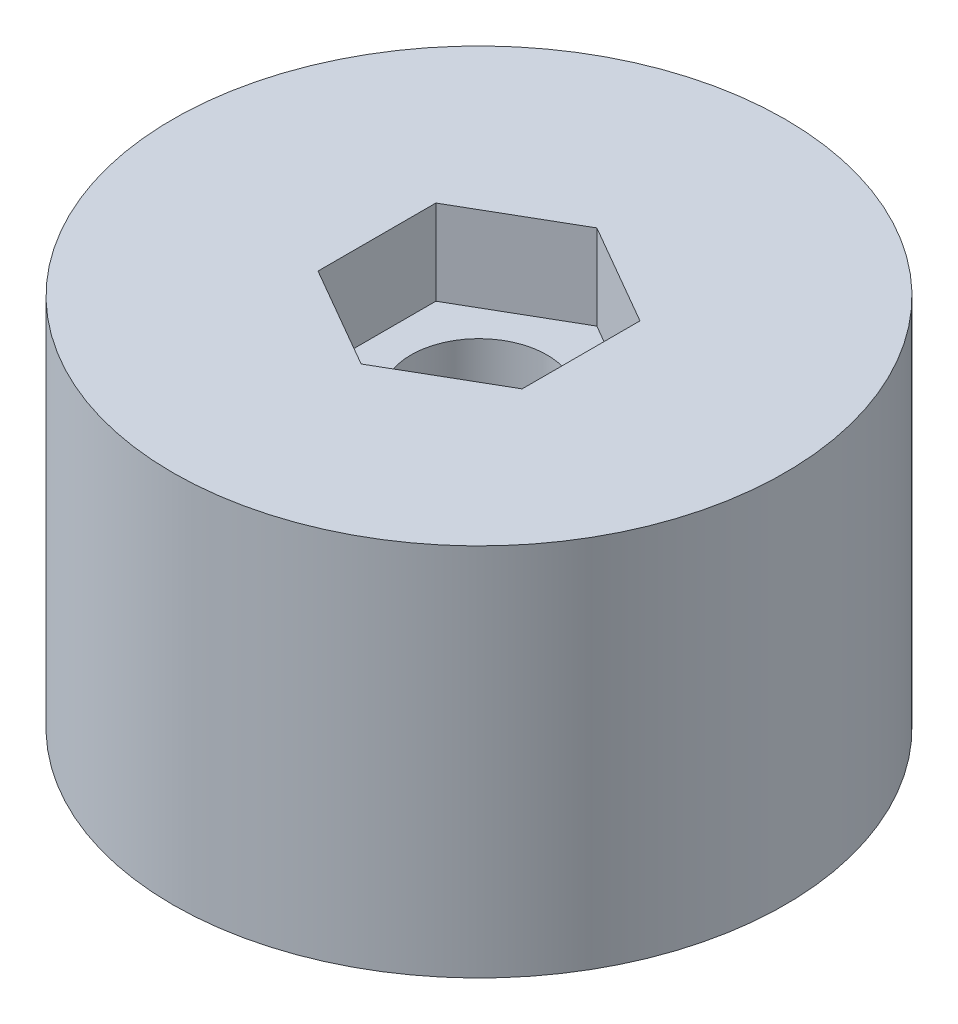
ISO-10303-21;
HEADER;
FILE_DESCRIPTION(('STEP AP214'),'2;1');
FILE_NAME('part.step','',(''),(''),'','','');
FILE_SCHEMA(('AUTOMOTIVE_DESIGN { 1 0 10303 214 1 1 1 1 }'));
ENDSEC;
DATA;
#1=APPLICATION_CONTEXT('core data for automotive mechanical design processes');
#2=APPLICATION_PROTOCOL_DEFINITION('international standard','automotive_design',2000,#1);
#3=PRODUCT_CONTEXT('',#1,'mechanical');
#4=PRODUCT('Part','Part','',(#3));
#5=PRODUCT_RELATED_PRODUCT_CATEGORY('part','',(#4));
#6=PRODUCT_DEFINITION_FORMATION('','',#4);
#7=PRODUCT_DEFINITION_CONTEXT('part definition',#1,'design');
#8=PRODUCT_DEFINITION('design','',#6,#7);
#9=PRODUCT_DEFINITION_SHAPE('','',#8);
#10=(LENGTH_UNIT() NAMED_UNIT(*) SI_UNIT(.MILLI.,.METRE.));
#11=(NAMED_UNIT(*) PLANE_ANGLE_UNIT() SI_UNIT($,.RADIAN.));
#12=(NAMED_UNIT(*) SI_UNIT($,.STERADIAN.) SOLID_ANGLE_UNIT());
#13=UNCERTAINTY_MEASURE_WITH_UNIT(LENGTH_MEASURE(1.E-05),#10,'distance_accuracy_value','');
#14=(GEOMETRIC_REPRESENTATION_CONTEXT(3) GLOBAL_UNCERTAINTY_ASSIGNED_CONTEXT((#13)) GLOBAL_UNIT_ASSIGNED_CONTEXT((#10,
#11,#12)) REPRESENTATION_CONTEXT('',''));
#15=CARTESIAN_POINT('',(0.,0.,0.));
#16=DIRECTION('',(0.,0.,1.));
#17=DIRECTION('',(1.,0.,0.));
#18=AXIS2_PLACEMENT_3D('',#15,#16,#17);
#19=CARTESIAN_POINT('',(0.,-0.000999999999999265,0.));
#20=DIRECTION('',(0.,1.,0.));
#21=DIRECTION('',(0.,0.,1.));
#22=AXIS2_PLACEMENT_3D('',#19,#20,#21);
#23=CYLINDRICAL_SURFACE('',#22,2.);
#24=CARTESIAN_POINT('',(0.,0.,0.));
#25=DIRECTION('',(0.,1.,0.));
#26=DIRECTION('',(0.,0.,1.));
#27=AXIS2_PLACEMENT_3D('',#24,#25,#26);
#28=CIRCLE('',#27,2.);
#29=CARTESIAN_POINT('',(0.,0.,2.));
#30=VERTEX_POINT('',#29);
#31=EDGE_CURVE('E143',#30,#30,#28,.F.);
#32=ORIENTED_EDGE('',*,*,#31,.T.);
#33=EDGE_LOOP('',(#32));
#34=FACE_BOUND('',#33,.T.);
#35=CARTESIAN_POINT('',(0.,8.5,0.));
#36=DIRECTION('',(0.,1.,0.));
#37=DIRECTION('',(0.,0.,1.));
#38=AXIS2_PLACEMENT_3D('',#35,#36,#37);
#39=CIRCLE('',#38,2.);
#40=CARTESIAN_POINT('',(0.,8.5,2.));
#41=VERTEX_POINT('',#40);
#42=EDGE_CURVE('E37',#41,#41,#39,.F.);
#43=ORIENTED_EDGE('',*,*,#42,.F.);
#44=EDGE_LOOP('',(#43));
#45=FACE_BOUND('',#44,.T.);
#46=ADVANCED_FACE('F33',(#34,#45),#23,.F.);
#47=CARTESIAN_POINT('',(0.,11.,0.));
#48=DIRECTION('',(0.,-1.,0.));
#49=DIRECTION('',(0.,0.,-1.));
#50=AXIS2_PLACEMENT_3D('',#47,#48,#49);
#51=CYLINDRICAL_SURFACE('',#50,9.);
#52=CARTESIAN_POINT('',(0.,11.,0.));
#53=DIRECTION('',(0.,1.,0.));
#54=DIRECTION('',(0.,0.,1.));
#55=AXIS2_PLACEMENT_3D('',#52,#53,#54);
#56=CIRCLE('',#55,9.);
#57=CARTESIAN_POINT('',(0.,11.,9.));
#58=VERTEX_POINT('',#57);
#59=EDGE_CURVE('E11',#58,#58,#56,.T.);
#60=ORIENTED_EDGE('',*,*,#59,.F.);
#61=EDGE_LOOP('',(#60));
#62=FACE_BOUND('',#61,.T.);
#63=CARTESIAN_POINT('',(0.,0.,0.));
#64=DIRECTION('',(0.,1.,0.));
#65=DIRECTION('',(0.,0.,1.));
#66=AXIS2_PLACEMENT_3D('',#63,#64,#65);
#67=CIRCLE('',#66,9.);
#68=CARTESIAN_POINT('',(0.,0.,9.));
#69=VERTEX_POINT('',#68);
#70=EDGE_CURVE('E42',#69,#69,#67,.T.);
#71=ORIENTED_EDGE('',*,*,#70,.T.);
#72=EDGE_LOOP('',(#71));
#73=FACE_BOUND('',#72,.T.);
#74=ADVANCED_FACE('F35',(#62,#73),#51,.T.);
#75=CARTESIAN_POINT('',(0.,11.,0.));
#76=DIRECTION('',(0.,1.,0.));
#77=DIRECTION('',(0.,0.,1.));
#78=AXIS2_PLACEMENT_3D('',#75,#76,#77);
#79=PLANE('',#78);
#80=DIRECTION('',(0.866025403784439,0.,-0.5));
#81=VECTOR('',#80,1.);
#82=CARTESIAN_POINT('',(0.,11.,3.46410161513776));
#83=LINE('',#82,#81);
#84=CARTESIAN_POINT('',(0.,11.,3.46410161513776));
#85=VERTEX_POINT('',#84);
#86=CARTESIAN_POINT('',(3.,11.,1.73205080756888));
#87=VERTEX_POINT('',#86);
#88=EDGE_CURVE('E50',#85,#87,#83,.T.);
#89=ORIENTED_EDGE('',*,*,#88,.F.);
#90=DIRECTION('',(0.866025403784439,0.,0.5));
#91=VECTOR('',#90,1.);
#92=CARTESIAN_POINT('',(-3.,11.,1.73205080756888));
#93=LINE('',#92,#91);
#94=CARTESIAN_POINT('',(-3.,11.,1.73205080756888));
#95=VERTEX_POINT('',#94);
#96=EDGE_CURVE('E134',#95,#85,#93,.T.);
#97=ORIENTED_EDGE('',*,*,#96,.F.);
#98=DIRECTION('',(0.,0.,1.));
#99=VECTOR('',#98,1.);
#100=CARTESIAN_POINT('',(-3.,11.,-1.73205080756888));
#101=LINE('',#100,#99);
#102=CARTESIAN_POINT('',(-3.,11.,-1.73205080756888));
#103=VERTEX_POINT('',#102);
#104=EDGE_CURVE('E132',#103,#95,#101,.T.);
#105=ORIENTED_EDGE('',*,*,#104,.F.);
#106=DIRECTION('',(-0.866025403784439,0.,0.5));
#107=VECTOR('',#106,1.);
#108=CARTESIAN_POINT('',(0.,11.,-3.46410161513776));
#109=LINE('',#108,#107);
#110=CARTESIAN_POINT('',(0.,11.,-3.46410161513776));
#111=VERTEX_POINT('',#110);
#112=EDGE_CURVE('E98',#111,#103,#109,.T.);
#113=ORIENTED_EDGE('',*,*,#112,.F.);
#114=DIRECTION('',(-0.866025403784439,0.,-0.5));
#115=VECTOR('',#114,1.);
#116=CARTESIAN_POINT('',(3.,11.,-1.73205080756888));
#117=LINE('',#116,#115);
#118=CARTESIAN_POINT('',(3.,11.,-1.73205080756888));
#119=VERTEX_POINT('',#118);
#120=EDGE_CURVE('E128',#119,#111,#117,.T.);
#121=ORIENTED_EDGE('',*,*,#120,.F.);
#122=DIRECTION('',(0.,0.,-1.));
#123=VECTOR('',#122,1.);
#124=CARTESIAN_POINT('',(3.,11.,1.73205080756888));
#125=LINE('',#124,#123);
#126=EDGE_CURVE('E125',#87,#119,#125,.T.);
#127=ORIENTED_EDGE('',*,*,#126,.F.);
#128=EDGE_LOOP('',(#89,#97,#105,#113,#121,#127));
#129=FACE_BOUND('',#128,.T.);
#130=ORIENTED_EDGE('',*,*,#59,.T.);
#131=EDGE_LOOP('',(#130));
#132=FACE_BOUND('',#131,.T.);
#133=ADVANCED_FACE('F151',(#129,#132),#79,.T.);
#134=CARTESIAN_POINT('',(0.,0.,0.));
#135=DIRECTION('',(0.,1.,0.));
#136=DIRECTION('',(0.,0.,1.));
#137=AXIS2_PLACEMENT_3D('',#134,#135,#136);
#138=PLANE('',#137);
#139=ORIENTED_EDGE('',*,*,#31,.F.);
#140=EDGE_LOOP('',(#139));
#141=FACE_BOUND('',#140,.T.);
#142=ORIENTED_EDGE('',*,*,#70,.F.);
#143=EDGE_LOOP('',(#142));
#144=FACE_BOUND('',#143,.T.);
#145=ADVANCED_FACE('F149',(#141,#144),#138,.F.);
#146=CARTESIAN_POINT('',(0.,8.5,0.));
#147=DIRECTION('',(0.,1.,0.));
#148=DIRECTION('',(0.,0.,1.));
#149=AXIS2_PLACEMENT_3D('',#146,#147,#148);
#150=PLANE('',#149);
#151=DIRECTION('',(0.866025403784439,0.,-0.5));
#152=VECTOR('',#151,1.);
#153=CARTESIAN_POINT('',(0.,8.5,3.46410161513776));
#154=LINE('',#153,#152);
#155=CARTESIAN_POINT('',(0.,8.5,3.46410161513776));
#156=VERTEX_POINT('',#155);
#157=CARTESIAN_POINT('',(3.,8.5,1.73205080756888));
#158=VERTEX_POINT('',#157);
#159=EDGE_CURVE('E136',#156,#158,#154,.T.);
#160=ORIENTED_EDGE('',*,*,#159,.T.);
#161=DIRECTION('',(0.,0.,-1.));
#162=VECTOR('',#161,1.);
#163=CARTESIAN_POINT('',(3.,8.5,1.73205080756888));
#164=LINE('',#163,#162);
#165=CARTESIAN_POINT('',(3.,8.5,-1.73205080756888));
#166=VERTEX_POINT('',#165);
#167=EDGE_CURVE('E119',#158,#166,#164,.T.);
#168=ORIENTED_EDGE('',*,*,#167,.T.);
#169=DIRECTION('',(-0.866025403784439,0.,-0.5));
#170=VECTOR('',#169,1.);
#171=CARTESIAN_POINT('',(3.,8.5,-1.73205080756888));
#172=LINE('',#171,#170);
#173=CARTESIAN_POINT('',(0.,8.5,-3.46410161513776));
#174=VERTEX_POINT('',#173);
#175=EDGE_CURVE('E117',#166,#174,#172,.T.);
#176=ORIENTED_EDGE('',*,*,#175,.T.);
#177=DIRECTION('',(-0.866025403784439,0.,0.5));
#178=VECTOR('',#177,1.);
#179=CARTESIAN_POINT('',(0.,8.5,-3.46410161513776));
#180=LINE('',#179,#178);
#181=CARTESIAN_POINT('',(-3.,8.5,-1.73205080756888));
#182=VERTEX_POINT('',#181);
#183=EDGE_CURVE('E95',#174,#182,#180,.T.);
#184=ORIENTED_EDGE('',*,*,#183,.T.);
#185=DIRECTION('',(0.,0.,1.));
#186=VECTOR('',#185,1.);
#187=CARTESIAN_POINT('',(-3.,8.5,-1.73205080756888));
#188=LINE('',#187,#186);
#189=CARTESIAN_POINT('',(-3.,8.5,1.73205080756888));
#190=VERTEX_POINT('',#189);
#191=EDGE_CURVE('E106',#182,#190,#188,.T.);
#192=ORIENTED_EDGE('',*,*,#191,.T.);
#193=DIRECTION('',(0.866025403784439,0.,0.5));
#194=VECTOR('',#193,1.);
#195=CARTESIAN_POINT('',(-3.,8.5,1.73205080756888));
#196=LINE('',#195,#194);
#197=EDGE_CURVE('E110',#190,#156,#196,.T.);
#198=ORIENTED_EDGE('',*,*,#197,.T.);
#199=EDGE_LOOP('',(#160,#168,#176,#184,#192,#198));
#200=FACE_BOUND('',#199,.T.);
#201=ORIENTED_EDGE('',*,*,#42,.T.);
#202=EDGE_LOOP('',(#201));
#203=FACE_BOUND('',#202,.T.);
#204=ADVANCED_FACE('F113',(#200,#203),#150,.T.);
#205=CARTESIAN_POINT('',(0.,8.5,3.46410161513776));
#206=DIRECTION('',(0.5,0.,0.866025403784439));
#207=DIRECTION('',(0.866025403784439,0.,-0.5));
#208=AXIS2_PLACEMENT_3D('',#205,#206,#207);
#209=PLANE('',#208);
#210=ORIENTED_EDGE('',*,*,#88,.T.);
#211=DIRECTION('',(0.,1.,0.));
#212=VECTOR('',#211,1.);
#213=CARTESIAN_POINT('',(3.,8.5,1.73205080756888));
#214=LINE('',#213,#212);
#215=EDGE_CURVE('E80',#158,#87,#214,.T.);
#216=ORIENTED_EDGE('',*,*,#215,.F.);
#217=ORIENTED_EDGE('',*,*,#159,.F.);
#218=DIRECTION('',(0.,1.,0.));
#219=VECTOR('',#218,1.);
#220=CARTESIAN_POINT('',(0.,8.5,3.46410161513776));
#221=LINE('',#220,#219);
#222=EDGE_CURVE('E58',#156,#85,#221,.T.);
#223=ORIENTED_EDGE('',*,*,#222,.T.);
#224=EDGE_LOOP('',(#210,#216,#217,#223));
#225=FACE_BOUND('',#224,.T.);
#226=ADVANCED_FACE('F157',(#225),#209,.F.);
#227=CARTESIAN_POINT('',(-3.,8.5,1.73205080756888));
#228=DIRECTION('',(-0.5,0.,0.866025403784438));
#229=DIRECTION('',(0.866025403784438,0.,0.5));
#230=AXIS2_PLACEMENT_3D('',#227,#228,#229);
#231=PLANE('',#230);
#232=ORIENTED_EDGE('',*,*,#96,.T.);
#233=ORIENTED_EDGE('',*,*,#222,.F.);
#234=ORIENTED_EDGE('',*,*,#197,.F.);
#235=DIRECTION('',(0.,1.,0.));
#236=VECTOR('',#235,1.);
#237=CARTESIAN_POINT('',(-3.,8.5,1.73205080756888));
#238=LINE('',#237,#236);
#239=EDGE_CURVE('E102',#190,#95,#238,.T.);
#240=ORIENTED_EDGE('',*,*,#239,.T.);
#241=EDGE_LOOP('',(#232,#233,#234,#240));
#242=FACE_BOUND('',#241,.T.);
#243=ADVANCED_FACE('F173',(#242),#231,.F.);
#244=CARTESIAN_POINT('',(-3.,8.5,-1.73205080756888));
#245=DIRECTION('',(-1.,0.,0.));
#246=DIRECTION('',(0.,0.,1.));
#247=AXIS2_PLACEMENT_3D('',#244,#245,#246);
#248=PLANE('',#247);
#249=ORIENTED_EDGE('',*,*,#104,.T.);
#250=ORIENTED_EDGE('',*,*,#239,.F.);
#251=ORIENTED_EDGE('',*,*,#191,.F.);
#252=DIRECTION('',(0.,1.,0.));
#253=VECTOR('',#252,1.);
#254=CARTESIAN_POINT('',(-3.,8.5,-1.73205080756888));
#255=LINE('',#254,#253);
#256=EDGE_CURVE('E91',#182,#103,#255,.T.);
#257=ORIENTED_EDGE('',*,*,#256,.T.);
#258=EDGE_LOOP('',(#249,#250,#251,#257));
#259=FACE_BOUND('',#258,.T.);
#260=ADVANCED_FACE('F107',(#259),#248,.F.);
#261=CARTESIAN_POINT('',(0.,8.5,-3.46410161513776));
#262=DIRECTION('',(-0.5,0.,-0.866025403784439));
#263=DIRECTION('',(-0.866025403784439,0.,0.5));
#264=AXIS2_PLACEMENT_3D('',#261,#262,#263);
#265=PLANE('',#264);
#266=ORIENTED_EDGE('',*,*,#112,.T.);
#267=ORIENTED_EDGE('',*,*,#256,.F.);
#268=ORIENTED_EDGE('',*,*,#183,.F.);
#269=DIRECTION('',(0.,1.,0.));
#270=VECTOR('',#269,1.);
#271=CARTESIAN_POINT('',(0.,8.5,-3.46410161513776));
#272=LINE('',#271,#270);
#273=EDGE_CURVE('E103',#174,#111,#272,.T.);
#274=ORIENTED_EDGE('',*,*,#273,.T.);
#275=EDGE_LOOP('',(#266,#267,#268,#274));
#276=FACE_BOUND('',#275,.T.);
#277=ADVANCED_FACE('F93',(#276),#265,.F.);
#278=CARTESIAN_POINT('',(3.,8.5,-1.73205080756888));
#279=DIRECTION('',(0.5,0.,-0.866025403784439));
#280=DIRECTION('',(-0.866025403784439,0.,-0.5));
#281=AXIS2_PLACEMENT_3D('',#278,#279,#280);
#282=PLANE('',#281);
#283=ORIENTED_EDGE('',*,*,#120,.T.);
#284=ORIENTED_EDGE('',*,*,#273,.F.);
#285=ORIENTED_EDGE('',*,*,#175,.F.);
#286=DIRECTION('',(0.,1.,0.));
#287=VECTOR('',#286,1.);
#288=CARTESIAN_POINT('',(3.,8.5,-1.73205080756888));
#289=LINE('',#288,#287);
#290=EDGE_CURVE('E140',#166,#119,#289,.T.);
#291=ORIENTED_EDGE('',*,*,#290,.T.);
#292=EDGE_LOOP('',(#283,#284,#285,#291));
#293=FACE_BOUND('',#292,.T.);
#294=ADVANCED_FACE('F177',(#293),#282,.F.);
#295=CARTESIAN_POINT('',(3.,8.5,1.73205080756888));
#296=DIRECTION('',(1.,0.,0.));
#297=DIRECTION('',(0.,0.,-1.));
#298=AXIS2_PLACEMENT_3D('',#295,#296,#297);
#299=PLANE('',#298);
#300=ORIENTED_EDGE('',*,*,#126,.T.);
#301=ORIENTED_EDGE('',*,*,#290,.F.);
#302=ORIENTED_EDGE('',*,*,#167,.F.);
#303=ORIENTED_EDGE('',*,*,#215,.T.);
#304=EDGE_LOOP('',(#300,#301,#302,#303));
#305=FACE_BOUND('',#304,.T.);
#306=ADVANCED_FACE('F174',(#305),#299,.F.);
#307=CLOSED_SHELL('',(#46,#74,#133,#145,#204,#226,#243,#260,#277,#294,#306));
#308=MANIFOLD_SOLID_BREP('B2',#307);
#309=ADVANCED_BREP_SHAPE_REPRESENTATION('',(#18,#308),#14);
#310=SHAPE_DEFINITION_REPRESENTATION(#9,#309);
ENDSEC;
END-ISO-10303-21;
